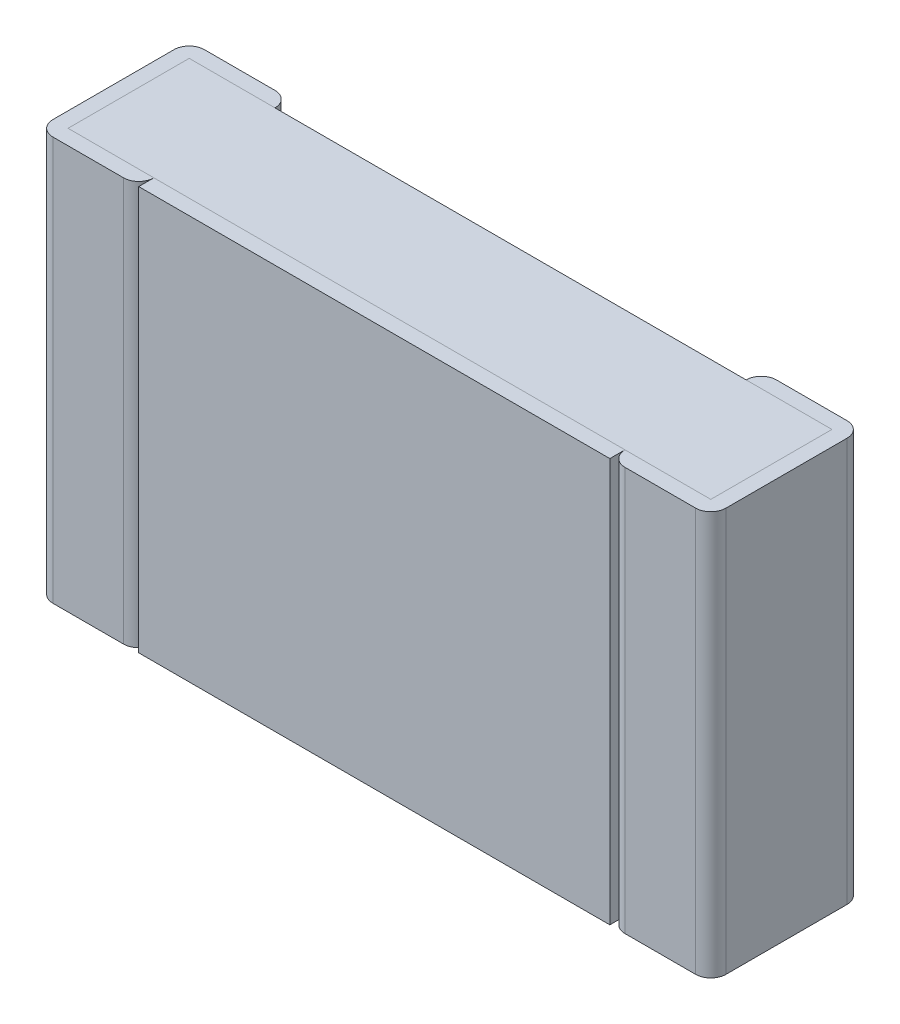
ISO-10303-21;
HEADER;
FILE_DESCRIPTION(('STEP AP214'),'2;1');
FILE_NAME('part.step','',(''),(''),'','','');
FILE_SCHEMA(('AUTOMOTIVE_DESIGN { 1 0 10303 214 1 1 1 1 }'));
ENDSEC;
DATA;
#1=APPLICATION_CONTEXT('core data for automotive mechanical design processes');
#2=APPLICATION_PROTOCOL_DEFINITION('international standard','automotive_design',2000,#1);
#3=PRODUCT_CONTEXT('',#1,'mechanical');
#4=PRODUCT('Part','Part','',(#3));
#5=PRODUCT_RELATED_PRODUCT_CATEGORY('part','',(#4));
#6=PRODUCT_DEFINITION_FORMATION('','',#4);
#7=PRODUCT_DEFINITION_CONTEXT('part definition',#1,'design');
#8=PRODUCT_DEFINITION('design','',#6,#7);
#9=PRODUCT_DEFINITION_SHAPE('','',#8);
#10=(LENGTH_UNIT() NAMED_UNIT(*) SI_UNIT(.MILLI.,.METRE.));
#11=(NAMED_UNIT(*) PLANE_ANGLE_UNIT() SI_UNIT($,.RADIAN.));
#12=(NAMED_UNIT(*) SI_UNIT($,.STERADIAN.) SOLID_ANGLE_UNIT());
#13=UNCERTAINTY_MEASURE_WITH_UNIT(LENGTH_MEASURE(1.E-05),#10,'distance_accuracy_value','');
#14=(GEOMETRIC_REPRESENTATION_CONTEXT(3) GLOBAL_UNCERTAINTY_ASSIGNED_CONTEXT((#13)) GLOBAL_UNIT_ASSIGNED_CONTEXT((#10,
#11,#12)) REPRESENTATION_CONTEXT('',''));
#15=CARTESIAN_POINT('',(0.,0.,0.));
#16=DIRECTION('',(0.,0.,1.));
#17=DIRECTION('',(1.,0.,0.));
#18=AXIS2_PLACEMENT_3D('',#15,#16,#17);
#19=CARTESIAN_POINT('',(-0.7,-0.6,0.45));
#20=DIRECTION('',(0.,0.,1.));
#21=DIRECTION('',(1.,0.,0.));
#22=AXIS2_PLACEMENT_3D('',#19,#20,#21);
#23=PLANE('',#22);
#24=DIRECTION('',(0.,1.,0.));
#25=VECTOR('',#24,1.);
#26=CARTESIAN_POINT('',(-0.7,-0.6,0.45));
#27=LINE('',#26,#25);
#28=CARTESIAN_POINT('',(-0.7,-0.6,0.45));
#29=VERTEX_POINT('',#28);
#30=CARTESIAN_POINT('',(-0.7,0.6,0.45));
#31=VERTEX_POINT('',#30);
#32=EDGE_CURVE('E263',#29,#31,#27,.T.);
#33=ORIENTED_EDGE('',*,*,#32,.F.);
#34=DIRECTION('',(1.,0.,0.));
#35=VECTOR('',#34,1.);
#36=CARTESIAN_POINT('',(-0.7,-0.6,0.45));
#37=LINE('',#36,#35);
#38=CARTESIAN_POINT('',(0.7,-0.6,0.45));
#39=VERTEX_POINT('',#38);
#40=EDGE_CURVE('E373',#29,#39,#37,.T.);
#41=ORIENTED_EDGE('',*,*,#40,.T.);
#42=DIRECTION('',(0.,1.,0.));
#43=VECTOR('',#42,1.);
#44=CARTESIAN_POINT('',(0.7,-0.6,0.45));
#45=LINE('',#44,#43);
#46=CARTESIAN_POINT('',(0.7,0.6,0.45));
#47=VERTEX_POINT('',#46);
#48=EDGE_CURVE('E11',#39,#47,#45,.T.);
#49=ORIENTED_EDGE('',*,*,#48,.T.);
#50=DIRECTION('',(1.,0.,0.));
#51=VECTOR('',#50,1.);
#52=CARTESIAN_POINT('',(-0.7,0.6,0.45));
#53=LINE('',#52,#51);
#54=EDGE_CURVE('E305',#31,#47,#53,.T.);
#55=ORIENTED_EDGE('',*,*,#54,.F.);
#56=EDGE_LOOP('',(#33,#41,#49,#55));
#57=FACE_BOUND('',#56,.T.);
#58=ADVANCED_FACE('F16',(#57),#23,.T.);
#59=CARTESIAN_POINT('',(0.7,-0.6,0.405));
#60=DIRECTION('',(1.,0.,0.));
#61=DIRECTION('',(0.,1.,0.));
#62=AXIS2_PLACEMENT_3D('',#59,#60,#61);
#63=PLANE('',#62);
#64=DIRECTION('',(0.,0.,1.));
#65=VECTOR('',#64,1.);
#66=CARTESIAN_POINT('',(0.7,-0.6,0.405));
#67=LINE('',#66,#65);
#68=CARTESIAN_POINT('',(0.7,-0.6,0.405));
#69=VERTEX_POINT('',#68);
#70=EDGE_CURVE('E328',#69,#39,#67,.T.);
#71=ORIENTED_EDGE('',*,*,#70,.F.);
#72=DIRECTION('',(0.,1.,0.));
#73=VECTOR('',#72,1.);
#74=CARTESIAN_POINT('',(0.7,-0.6,0.405));
#75=LINE('',#74,#73);
#76=CARTESIAN_POINT('',(0.7,0.6,0.405));
#77=VERTEX_POINT('',#76);
#78=EDGE_CURVE('E26',#69,#77,#75,.T.);
#79=ORIENTED_EDGE('',*,*,#78,.T.);
#80=DIRECTION('',(0.,0.,1.));
#81=VECTOR('',#80,1.);
#82=CARTESIAN_POINT('',(0.7,0.6,0.405));
#83=LINE('',#82,#81);
#84=EDGE_CURVE('E279',#77,#47,#83,.T.);
#85=ORIENTED_EDGE('',*,*,#84,.T.);
#86=ORIENTED_EDGE('',*,*,#48,.F.);
#87=EDGE_LOOP('',(#71,#79,#85,#86));
#88=FACE_BOUND('',#87,.T.);
#89=ADVANCED_FACE('F542',(#88),#63,.T.);
#90=CARTESIAN_POINT('',(0.745,-0.6,0.405));
#91=DIRECTION('',(0.,1.,0.));
#92=DIRECTION('',(-1.,0.,0.));
#93=AXIS2_PLACEMENT_3D('',#90,#91,#92);
#94=CYLINDRICAL_SURFACE('',#93,0.045);
#95=CARTESIAN_POINT('',(0.745,-0.6,0.405));
#96=DIRECTION('',(0.,1.,0.));
#97=DIRECTION('',(0.,0.,1.));
#98=AXIS2_PLACEMENT_3D('',#95,#96,#97);
#99=CIRCLE('',#98,0.045);
#100=CARTESIAN_POINT('',(0.745,-0.6,0.45));
#101=VERTEX_POINT('',#100);
#102=EDGE_CURVE('E208',#69,#101,#99,.T.);
#103=ORIENTED_EDGE('',*,*,#102,.T.);
#104=DIRECTION('',(0.,1.,0.));
#105=VECTOR('',#104,1.);
#106=CARTESIAN_POINT('',(0.745,-0.6,0.45));
#107=LINE('',#106,#105);
#108=CARTESIAN_POINT('',(0.745,0.6,0.45));
#109=VERTEX_POINT('',#108);
#110=EDGE_CURVE('E202',#101,#109,#107,.T.);
#111=ORIENTED_EDGE('',*,*,#110,.T.);
#112=CARTESIAN_POINT('',(0.745,0.6,0.405));
#113=DIRECTION('',(0.,1.,0.));
#114=DIRECTION('',(0.,0.,1.));
#115=AXIS2_PLACEMENT_3D('',#112,#113,#114);
#116=CIRCLE('',#115,0.045);
#117=EDGE_CURVE('E205',#77,#109,#116,.T.);
#118=ORIENTED_EDGE('',*,*,#117,.F.);
#119=ORIENTED_EDGE('',*,*,#78,.F.);
#120=EDGE_LOOP('',(#103,#111,#118,#119));
#121=FACE_BOUND('',#120,.T.);
#122=ADVANCED_FACE('F203',(#121),#94,.T.);
#123=CARTESIAN_POINT('',(0.7,-0.6,0.45));
#124=DIRECTION('',(0.,0.,1.));
#125=DIRECTION('',(1.,0.,0.));
#126=AXIS2_PLACEMENT_3D('',#123,#124,#125);
#127=PLANE('',#126);
#128=DIRECTION('',(1.,0.,0.));
#129=VECTOR('',#128,1.);
#130=CARTESIAN_POINT('',(0.7,0.6,0.45));
#131=LINE('',#130,#129);
#132=CARTESIAN_POINT('',(0.955,0.6,0.45));
#133=VERTEX_POINT('',#132);
#134=EDGE_CURVE('E213',#109,#133,#131,.T.);
#135=ORIENTED_EDGE('',*,*,#134,.F.);
#136=ORIENTED_EDGE('',*,*,#110,.F.);
#137=DIRECTION('',(1.,0.,0.));
#138=VECTOR('',#137,1.);
#139=CARTESIAN_POINT('',(0.7,-0.6,0.45));
#140=LINE('',#139,#138);
#141=CARTESIAN_POINT('',(0.955,-0.6,0.45));
#142=VERTEX_POINT('',#141);
#143=EDGE_CURVE('E248',#101,#142,#140,.T.);
#144=ORIENTED_EDGE('',*,*,#143,.T.);
#145=DIRECTION('',(0.,1.,0.));
#146=VECTOR('',#145,1.);
#147=CARTESIAN_POINT('',(0.955,-0.6,0.45));
#148=LINE('',#147,#146);
#149=EDGE_CURVE('E193',#142,#133,#148,.T.);
#150=ORIENTED_EDGE('',*,*,#149,.T.);
#151=EDGE_LOOP('',(#135,#136,#144,#150));
#152=FACE_BOUND('',#151,.T.);
#153=ADVANCED_FACE('F214',(#152),#127,.T.);
#154=CARTESIAN_POINT('',(0.955,-0.6,0.405));
#155=DIRECTION('',(0.,1.,0.));
#156=DIRECTION('',(1.,0.,0.));
#157=AXIS2_PLACEMENT_3D('',#154,#155,#156);
#158=CYLINDRICAL_SURFACE('',#157,0.045);
#159=DIRECTION('',(0.,1.,0.));
#160=VECTOR('',#159,1.);
#161=CARTESIAN_POINT('',(1.,-0.6,0.405));
#162=LINE('',#161,#160);
#163=CARTESIAN_POINT('',(1.,-0.6,0.405));
#164=VERTEX_POINT('',#163);
#165=CARTESIAN_POINT('',(1.,0.6,0.405));
#166=VERTEX_POINT('',#165);
#167=EDGE_CURVE('E258',#164,#166,#162,.T.);
#168=ORIENTED_EDGE('',*,*,#167,.T.);
#169=CARTESIAN_POINT('',(0.955,0.6,0.405));
#170=DIRECTION('',(0.,-1.,0.));
#171=DIRECTION('',(0.,0.,1.));
#172=AXIS2_PLACEMENT_3D('',#169,#170,#171);
#173=CIRCLE('',#172,0.045);
#174=EDGE_CURVE('E218',#166,#133,#173,.T.);
#175=ORIENTED_EDGE('',*,*,#174,.T.);
#176=ORIENTED_EDGE('',*,*,#149,.F.);
#177=CARTESIAN_POINT('',(0.955,-0.6,0.405));
#178=DIRECTION('',(0.,-1.,0.));
#179=DIRECTION('',(0.,0.,1.));
#180=AXIS2_PLACEMENT_3D('',#177,#178,#179);
#181=CIRCLE('',#180,0.045);
#182=EDGE_CURVE('E244',#164,#142,#181,.T.);
#183=ORIENTED_EDGE('',*,*,#182,.F.);
#184=EDGE_LOOP('',(#168,#175,#176,#183));
#185=FACE_BOUND('',#184,.T.);
#186=ADVANCED_FACE('F517',(#185),#158,.T.);
#187=CARTESIAN_POINT('',(1.,-0.6,0.));
#188=DIRECTION('',(1.,0.,0.));
#189=DIRECTION('',(0.,1.,0.));
#190=AXIS2_PLACEMENT_3D('',#187,#188,#189);
#191=PLANE('',#190);
#192=DIRECTION('',(0.,0.,1.));
#193=VECTOR('',#192,1.);
#194=CARTESIAN_POINT('',(1.,-0.6,0.));
#195=LINE('',#194,#193);
#196=CARTESIAN_POINT('',(1.,-0.6,0.045));
#197=VERTEX_POINT('',#196);
#198=EDGE_CURVE('E249',#197,#164,#195,.T.);
#199=ORIENTED_EDGE('',*,*,#198,.F.);
#200=DIRECTION('',(0.,1.,0.));
#201=VECTOR('',#200,1.);
#202=CARTESIAN_POINT('',(1.,-0.6,0.045));
#203=LINE('',#202,#201);
#204=CARTESIAN_POINT('',(1.,0.6,0.045));
#205=VERTEX_POINT('',#204);
#206=EDGE_CURVE('E272',#197,#205,#203,.T.);
#207=ORIENTED_EDGE('',*,*,#206,.T.);
#208=DIRECTION('',(0.,0.,1.));
#209=VECTOR('',#208,1.);
#210=CARTESIAN_POINT('',(1.,0.6,0.));
#211=LINE('',#210,#209);
#212=EDGE_CURVE('E332',#205,#166,#211,.T.);
#213=ORIENTED_EDGE('',*,*,#212,.T.);
#214=ORIENTED_EDGE('',*,*,#167,.F.);
#215=EDGE_LOOP('',(#199,#207,#213,#214));
#216=FACE_BOUND('',#215,.T.);
#217=ADVANCED_FACE('F514',(#216),#191,.T.);
#218=CARTESIAN_POINT('',(0.955,-0.6,0.045));
#219=DIRECTION('',(0.,1.,0.));
#220=DIRECTION('',(1.,0.,0.));
#221=AXIS2_PLACEMENT_3D('',#218,#219,#220);
#222=CYLINDRICAL_SURFACE('',#221,0.045);
#223=CARTESIAN_POINT('',(0.955,-0.6,0.045));
#224=DIRECTION('',(0.,1.,0.));
#225=DIRECTION('',(0.,0.,1.));
#226=AXIS2_PLACEMENT_3D('',#223,#224,#225);
#227=CIRCLE('',#226,0.045);
#228=CARTESIAN_POINT('',(0.955,-0.6,0.));
#229=VERTEX_POINT('',#228);
#230=EDGE_CURVE('E19',#197,#229,#227,.T.);
#231=ORIENTED_EDGE('',*,*,#230,.T.);
#232=DIRECTION('',(0.,1.,0.));
#233=VECTOR('',#232,1.);
#234=CARTESIAN_POINT('',(0.955,-0.6,0.));
#235=LINE('',#234,#233);
#236=CARTESIAN_POINT('',(0.955,0.6,0.));
#237=VERTEX_POINT('',#236);
#238=EDGE_CURVE('E275',#229,#237,#235,.T.);
#239=ORIENTED_EDGE('',*,*,#238,.T.);
#240=CARTESIAN_POINT('',(0.955,0.6,0.045));
#241=DIRECTION('',(0.,1.,0.));
#242=DIRECTION('',(0.,0.,1.));
#243=AXIS2_PLACEMENT_3D('',#240,#241,#242);
#244=CIRCLE('',#243,0.045);
#245=EDGE_CURVE('E329',#205,#237,#244,.T.);
#246=ORIENTED_EDGE('',*,*,#245,.F.);
#247=ORIENTED_EDGE('',*,*,#206,.F.);
#248=EDGE_LOOP('',(#231,#239,#246,#247));
#249=FACE_BOUND('',#248,.T.);
#250=ADVANCED_FACE('F409',(#249),#222,.T.);
#251=CARTESIAN_POINT('',(0.7,-0.6,0.));
#252=DIRECTION('',(0.,0.,1.));
#253=DIRECTION('',(1.,0.,0.));
#254=AXIS2_PLACEMENT_3D('',#251,#252,#253);
#255=PLANE('',#254);
#256=ORIENTED_EDGE('',*,*,#238,.F.);
#257=DIRECTION('',(1.,0.,0.));
#258=VECTOR('',#257,1.);
#259=CARTESIAN_POINT('',(0.7,-0.6,0.));
#260=LINE('',#259,#258);
#261=CARTESIAN_POINT('',(0.745,-0.6,0.));
#262=VERTEX_POINT('',#261);
#263=EDGE_CURVE('E324',#262,#229,#260,.T.);
#264=ORIENTED_EDGE('',*,*,#263,.F.);
#265=DIRECTION('',(0.,1.,0.));
#266=VECTOR('',#265,1.);
#267=CARTESIAN_POINT('',(0.745,-0.6,0.));
#268=LINE('',#267,#266);
#269=CARTESIAN_POINT('',(0.745,0.6,0.));
#270=VERTEX_POINT('',#269);
#271=EDGE_CURVE('E276',#262,#270,#268,.T.);
#272=ORIENTED_EDGE('',*,*,#271,.T.);
#273=DIRECTION('',(1.,0.,0.));
#274=VECTOR('',#273,1.);
#275=CARTESIAN_POINT('',(0.7,0.6,0.));
#276=LINE('',#275,#274);
#277=EDGE_CURVE('E232',#270,#237,#276,.T.);
#278=ORIENTED_EDGE('',*,*,#277,.T.);
#279=EDGE_LOOP('',(#256,#264,#272,#278));
#280=FACE_BOUND('',#279,.T.);
#281=ADVANCED_FACE('F511',(#280),#255,.F.);
#282=CARTESIAN_POINT('',(0.745,-0.6,0.045));
#283=DIRECTION('',(0.,1.,0.));
#284=DIRECTION('',(-1.,0.,0.));
#285=AXIS2_PLACEMENT_3D('',#282,#283,#284);
#286=CYLINDRICAL_SURFACE('',#285,0.045);
#287=DIRECTION('',(0.,1.,0.));
#288=VECTOR('',#287,1.);
#289=CARTESIAN_POINT('',(0.7,-0.6,0.045));
#290=LINE('',#289,#288);
#291=CARTESIAN_POINT('',(0.7,-0.6,0.045));
#292=VERTEX_POINT('',#291);
#293=CARTESIAN_POINT('',(0.7,0.6,0.045));
#294=VERTEX_POINT('',#293);
#295=EDGE_CURVE('E268',#292,#294,#290,.T.);
#296=ORIENTED_EDGE('',*,*,#295,.T.);
#297=CARTESIAN_POINT('',(0.745,0.6,0.045));
#298=DIRECTION('',(0.,-1.,0.));
#299=DIRECTION('',(0.,0.,1.));
#300=AXIS2_PLACEMENT_3D('',#297,#298,#299);
#301=CIRCLE('',#300,0.045);
#302=EDGE_CURVE('E226',#294,#270,#301,.T.);
#303=ORIENTED_EDGE('',*,*,#302,.T.);
#304=ORIENTED_EDGE('',*,*,#271,.F.);
#305=CARTESIAN_POINT('',(0.745,-0.6,0.045));
#306=DIRECTION('',(0.,-1.,0.));
#307=DIRECTION('',(0.,0.,1.));
#308=AXIS2_PLACEMENT_3D('',#305,#306,#307);
#309=CIRCLE('',#308,0.045);
#310=EDGE_CURVE('E142',#292,#262,#309,.T.);
#311=ORIENTED_EDGE('',*,*,#310,.F.);
#312=EDGE_LOOP('',(#296,#303,#304,#311));
#313=FACE_BOUND('',#312,.T.);
#314=ADVANCED_FACE('F527',(#313),#286,.T.);
#315=CARTESIAN_POINT('',(-0.7,0.6,0.405));
#316=DIRECTION('',(0.,1.,0.));
#317=DIRECTION('',(1.,0.,0.));
#318=AXIS2_PLACEMENT_3D('',#315,#316,#317);
#319=PLANE('',#318);
#320=DIRECTION('',(1.,0.,0.));
#321=VECTOR('',#320,1.);
#322=CARTESIAN_POINT('',(-0.7,0.6,0.405));
#323=LINE('',#322,#321);
#324=CARTESIAN_POINT('',(-0.7,0.6,0.405));
#325=VERTEX_POINT('',#324);
#326=EDGE_CURVE('E306',#325,#77,#323,.T.);
#327=ORIENTED_EDGE('',*,*,#326,.F.);
#328=DIRECTION('',(0.,0.,1.));
#329=VECTOR('',#328,1.);
#330=CARTESIAN_POINT('',(-0.7,0.6,0.405));
#331=LINE('',#330,#329);
#332=EDGE_CURVE('E259',#325,#31,#331,.T.);
#333=ORIENTED_EDGE('',*,*,#332,.T.);
#334=ORIENTED_EDGE('',*,*,#54,.T.);
#335=ORIENTED_EDGE('',*,*,#84,.F.);
#336=EDGE_LOOP('',(#327,#333,#334,#335));
#337=FACE_BOUND('',#336,.T.);
#338=ADVANCED_FACE('F529',(#337),#319,.T.);
#339=CARTESIAN_POINT('',(0.7,0.6,0.));
#340=DIRECTION('',(0.,1.,0.));
#341=DIRECTION('',(1.,0.,0.));
#342=AXIS2_PLACEMENT_3D('',#339,#340,#341);
#343=PLANE('',#342);
#344=ORIENTED_EDGE('',*,*,#277,.F.);
#345=ORIENTED_EDGE('',*,*,#302,.F.);
#346=DIRECTION('',(1.,0.,0.));
#347=VECTOR('',#346,1.);
#348=CARTESIAN_POINT('',(-0.955,0.6,0.045));
#349=LINE('',#348,#347);
#350=CARTESIAN_POINT('',(0.955,0.6,0.045));
#351=VERTEX_POINT('',#350);
#352=EDGE_CURVE('E388',#294,#351,#349,.T.);
#353=ORIENTED_EDGE('',*,*,#352,.T.);
#354=DIRECTION('',(0.,0.,1.));
#355=VECTOR('',#354,1.);
#356=CARTESIAN_POINT('',(0.955,0.6,0.045));
#357=LINE('',#356,#355);
#358=CARTESIAN_POINT('',(0.955,0.6,0.405));
#359=VERTEX_POINT('',#358);
#360=EDGE_CURVE('E359',#351,#359,#357,.T.);
#361=ORIENTED_EDGE('',*,*,#360,.T.);
#362=DIRECTION('',(1.,0.,0.));
#363=VECTOR('',#362,1.);
#364=CARTESIAN_POINT('',(-0.955,0.6,0.405));
#365=LINE('',#364,#363);
#366=EDGE_CURVE('E223',#77,#359,#365,.T.);
#367=ORIENTED_EDGE('',*,*,#366,.F.);
#368=ORIENTED_EDGE('',*,*,#117,.T.);
#369=ORIENTED_EDGE('',*,*,#134,.T.);
#370=ORIENTED_EDGE('',*,*,#174,.F.);
#371=ORIENTED_EDGE('',*,*,#212,.F.);
#372=ORIENTED_EDGE('',*,*,#245,.T.);
#373=EDGE_LOOP('',(#344,#345,#353,#361,#367,#368,#369,#370,#371,#372));
#374=FACE_BOUND('',#373,.T.);
#375=ADVANCED_FACE('F221',(#374),#343,.T.);
#376=CARTESIAN_POINT('',(-0.7,-0.6,0.405));
#377=DIRECTION('',(1.,0.,0.));
#378=DIRECTION('',(0.,1.,0.));
#379=AXIS2_PLACEMENT_3D('',#376,#377,#378);
#380=PLANE('',#379);
#381=ORIENTED_EDGE('',*,*,#32,.T.);
#382=ORIENTED_EDGE('',*,*,#332,.F.);
#383=DIRECTION('',(0.,1.,0.));
#384=VECTOR('',#383,1.);
#385=CARTESIAN_POINT('',(-0.7,-0.6,0.405));
#386=LINE('',#385,#384);
#387=CARTESIAN_POINT('',(-0.7,-0.6,0.405));
#388=VERTEX_POINT('',#387);
#389=EDGE_CURVE('E309',#388,#325,#386,.T.);
#390=ORIENTED_EDGE('',*,*,#389,.F.);
#391=DIRECTION('',(0.,0.,1.));
#392=VECTOR('',#391,1.);
#393=CARTESIAN_POINT('',(-0.7,-0.6,0.405));
#394=LINE('',#393,#392);
#395=EDGE_CURVE('E291',#388,#29,#394,.T.);
#396=ORIENTED_EDGE('',*,*,#395,.T.);
#397=EDGE_LOOP('',(#381,#382,#390,#396));
#398=FACE_BOUND('',#397,.T.);
#399=ADVANCED_FACE('F549',(#398),#380,.F.);
#400=CARTESIAN_POINT('',(-0.7,-0.6,0.405));
#401=DIRECTION('',(0.,1.,0.));
#402=DIRECTION('',(1.,0.,0.));
#403=AXIS2_PLACEMENT_3D('',#400,#401,#402);
#404=PLANE('',#403);
#405=ORIENTED_EDGE('',*,*,#70,.T.);
#406=ORIENTED_EDGE('',*,*,#40,.F.);
#407=ORIENTED_EDGE('',*,*,#395,.F.);
#408=DIRECTION('',(1.,0.,0.));
#409=VECTOR('',#408,1.);
#410=CARTESIAN_POINT('',(-0.7,-0.6,0.405));
#411=LINE('',#410,#409);
#412=EDGE_CURVE('E297',#388,#69,#411,.T.);
#413=ORIENTED_EDGE('',*,*,#412,.T.);
#414=EDGE_LOOP('',(#405,#406,#407,#413));
#415=FACE_BOUND('',#414,.T.);
#416=ADVANCED_FACE('F520',(#415),#404,.F.);
#417=CARTESIAN_POINT('',(0.7,-0.6,0.));
#418=DIRECTION('',(0.,1.,0.));
#419=DIRECTION('',(1.,0.,0.));
#420=AXIS2_PLACEMENT_3D('',#417,#418,#419);
#421=PLANE('',#420);
#422=ORIENTED_EDGE('',*,*,#230,.F.);
#423=ORIENTED_EDGE('',*,*,#198,.T.);
#424=ORIENTED_EDGE('',*,*,#182,.T.);
#425=ORIENTED_EDGE('',*,*,#143,.F.);
#426=ORIENTED_EDGE('',*,*,#102,.F.);
#427=DIRECTION('',(1.,0.,0.));
#428=VECTOR('',#427,1.);
#429=CARTESIAN_POINT('',(-0.955,-0.6,0.405));
#430=LINE('',#429,#428);
#431=CARTESIAN_POINT('',(0.955,-0.6,0.405));
#432=VERTEX_POINT('',#431);
#433=EDGE_CURVE('E302',#69,#432,#430,.T.);
#434=ORIENTED_EDGE('',*,*,#433,.T.);
#435=DIRECTION('',(0.,0.,1.));
#436=VECTOR('',#435,1.);
#437=CARTESIAN_POINT('',(0.955,-0.6,0.045));
#438=LINE('',#437,#436);
#439=CARTESIAN_POINT('',(0.955,-0.6,0.045));
#440=VERTEX_POINT('',#439);
#441=EDGE_CURVE('E153',#440,#432,#438,.T.);
#442=ORIENTED_EDGE('',*,*,#441,.F.);
#443=DIRECTION('',(1.,0.,0.));
#444=VECTOR('',#443,1.);
#445=CARTESIAN_POINT('',(-0.955,-0.6,0.045));
#446=LINE('',#445,#444);
#447=EDGE_CURVE('E379',#292,#440,#446,.T.);
#448=ORIENTED_EDGE('',*,*,#447,.F.);
#449=ORIENTED_EDGE('',*,*,#310,.T.);
#450=ORIENTED_EDGE('',*,*,#263,.T.);
#451=EDGE_LOOP('',(#422,#423,#424,#425,#426,#434,#442,#448,#449,#450));
#452=FACE_BOUND('',#451,.T.);
#453=ADVANCED_FACE('F411',(#452),#421,.F.);
#454=CARTESIAN_POINT('',(-0.955,-0.6,0.045));
#455=DIRECTION('',(0.,0.,1.));
#456=DIRECTION('',(1.,0.,0.));
#457=AXIS2_PLACEMENT_3D('',#454,#455,#456);
#458=PLANE('',#457);
#459=DIRECTION('',(1.,0.,0.));
#460=VECTOR('',#459,1.);
#461=CARTESIAN_POINT('',(-0.955,0.6,0.045));
#462=LINE('',#461,#460);
#463=CARTESIAN_POINT('',(-0.7,0.6,0.045));
#464=VERTEX_POINT('',#463);
#465=EDGE_CURVE('E271',#464,#294,#462,.T.);
#466=ORIENTED_EDGE('',*,*,#465,.T.);
#467=ORIENTED_EDGE('',*,*,#295,.F.);
#468=DIRECTION('',(1.,0.,0.));
#469=VECTOR('',#468,1.);
#470=CARTESIAN_POINT('',(-0.955,-0.6,0.045));
#471=LINE('',#470,#469);
#472=CARTESIAN_POINT('',(-0.7,-0.6,0.045));
#473=VERTEX_POINT('',#472);
#474=EDGE_CURVE('E382',#473,#292,#471,.T.);
#475=ORIENTED_EDGE('',*,*,#474,.F.);
#476=DIRECTION('',(0.,1.,0.));
#477=VECTOR('',#476,1.);
#478=CARTESIAN_POINT('',(-0.7,-0.6,0.045));
#479=LINE('',#478,#477);
#480=EDGE_CURVE('E355',#473,#464,#479,.T.);
#481=ORIENTED_EDGE('',*,*,#480,.T.);
#482=EDGE_LOOP('',(#466,#467,#475,#481));
#483=FACE_BOUND('',#482,.T.);
#484=ADVANCED_FACE('F525',(#483),#458,.F.);
#485=CARTESIAN_POINT('',(-0.955,0.6,0.045));
#486=DIRECTION('',(0.,1.,0.));
#487=DIRECTION('',(1.,0.,0.));
#488=AXIS2_PLACEMENT_3D('',#485,#486,#487);
#489=PLANE('',#488);
#490=DIRECTION('',(1.,0.,0.));
#491=VECTOR('',#490,1.);
#492=CARTESIAN_POINT('',(-0.955,0.6,0.045));
#493=LINE('',#492,#491);
#494=CARTESIAN_POINT('',(-0.955,0.6,0.045));
#495=VERTEX_POINT('',#494);
#496=EDGE_CURVE('E235',#495,#464,#493,.T.);
#497=ORIENTED_EDGE('',*,*,#496,.F.);
#498=DIRECTION('',(0.,0.,1.));
#499=VECTOR('',#498,1.);
#500=CARTESIAN_POINT('',(-0.955,0.6,0.045));
#501=LINE('',#500,#499);
#502=CARTESIAN_POINT('',(-0.955,0.6,0.405));
#503=VERTEX_POINT('',#502);
#504=EDGE_CURVE('E376',#495,#503,#501,.T.);
#505=ORIENTED_EDGE('',*,*,#504,.T.);
#506=DIRECTION('',(1.,0.,0.));
#507=VECTOR('',#506,1.);
#508=CARTESIAN_POINT('',(-0.955,0.6,0.405));
#509=LINE('',#508,#507);
#510=EDGE_CURVE('E319',#503,#325,#509,.T.);
#511=ORIENTED_EDGE('',*,*,#510,.T.);
#512=ORIENTED_EDGE('',*,*,#326,.T.);
#513=ORIENTED_EDGE('',*,*,#366,.T.);
#514=ORIENTED_EDGE('',*,*,#360,.F.);
#515=ORIENTED_EDGE('',*,*,#352,.F.);
#516=ORIENTED_EDGE('',*,*,#465,.F.);
#517=EDGE_LOOP('',(#497,#505,#511,#512,#513,#514,#515,#516));
#518=FACE_BOUND('',#517,.T.);
#519=ADVANCED_FACE('F556',(#518),#489,.T.);
#520=CARTESIAN_POINT('',(-0.745,-0.6,0.405));
#521=DIRECTION('',(0.,1.,0.));
#522=DIRECTION('',(1.,0.,0.));
#523=AXIS2_PLACEMENT_3D('',#520,#521,#522);
#524=CYLINDRICAL_SURFACE('',#523,0.045);
#525=ORIENTED_EDGE('',*,*,#389,.T.);
#526=CARTESIAN_POINT('',(-0.745,0.6,0.405));
#527=DIRECTION('',(0.,-1.,0.));
#528=DIRECTION('',(0.,0.,1.));
#529=AXIS2_PLACEMENT_3D('',#526,#527,#528);
#530=CIRCLE('',#529,0.045);
#531=CARTESIAN_POINT('',(-0.745,0.6,0.45));
#532=VERTEX_POINT('',#531);
#533=EDGE_CURVE('E315',#325,#532,#530,.T.);
#534=ORIENTED_EDGE('',*,*,#533,.T.);
#535=DIRECTION('',(0.,1.,0.));
#536=VECTOR('',#535,1.);
#537=CARTESIAN_POINT('',(-0.745,-0.6,0.45));
#538=LINE('',#537,#536);
#539=CARTESIAN_POINT('',(-0.745,-0.6,0.45));
#540=VERTEX_POINT('',#539);
#541=EDGE_CURVE('E301',#540,#532,#538,.T.);
#542=ORIENTED_EDGE('',*,*,#541,.F.);
#543=CARTESIAN_POINT('',(-0.745,-0.6,0.405));
#544=DIRECTION('',(0.,-1.,0.));
#545=DIRECTION('',(0.,0.,1.));
#546=AXIS2_PLACEMENT_3D('',#543,#544,#545);
#547=CIRCLE('',#546,0.045);
#548=EDGE_CURVE('E383',#388,#540,#547,.T.);
#549=ORIENTED_EDGE('',*,*,#548,.F.);
#550=EDGE_LOOP('',(#525,#534,#542,#549));
#551=FACE_BOUND('',#550,.T.);
#552=ADVANCED_FACE('F552',(#551),#524,.T.);
#553=CARTESIAN_POINT('',(-1.,-0.6,0.45));
#554=DIRECTION('',(0.,0.,1.));
#555=DIRECTION('',(1.,0.,0.));
#556=AXIS2_PLACEMENT_3D('',#553,#554,#555);
#557=PLANE('',#556);
#558=DIRECTION('',(1.,0.,0.));
#559=VECTOR('',#558,1.);
#560=CARTESIAN_POINT('',(-1.,0.6,0.45));
#561=LINE('',#560,#559);
#562=CARTESIAN_POINT('',(-0.955,0.6,0.45));
#563=VERTEX_POINT('',#562);
#564=EDGE_CURVE('E284',#563,#532,#561,.T.);
#565=ORIENTED_EDGE('',*,*,#564,.F.);
#566=DIRECTION('',(0.,1.,0.));
#567=VECTOR('',#566,1.);
#568=CARTESIAN_POINT('',(-0.955,-0.6,0.45));
#569=LINE('',#568,#567);
#570=CARTESIAN_POINT('',(-0.955,-0.6,0.45));
#571=VERTEX_POINT('',#570);
#572=EDGE_CURVE('E253',#571,#563,#569,.T.);
#573=ORIENTED_EDGE('',*,*,#572,.F.);
#574=DIRECTION('',(1.,0.,0.));
#575=VECTOR('',#574,1.);
#576=CARTESIAN_POINT('',(-1.,-0.6,0.45));
#577=LINE('',#576,#575);
#578=EDGE_CURVE('E387',#571,#540,#577,.T.);
#579=ORIENTED_EDGE('',*,*,#578,.T.);
#580=ORIENTED_EDGE('',*,*,#541,.T.);
#581=EDGE_LOOP('',(#565,#573,#579,#580));
#582=FACE_BOUND('',#581,.T.);
#583=ADVANCED_FACE('F562',(#582),#557,.T.);
#584=CARTESIAN_POINT('',(-0.955,-0.6,0.045));
#585=DIRECTION('',(0.,1.,0.));
#586=DIRECTION('',(1.,0.,0.));
#587=AXIS2_PLACEMENT_3D('',#584,#585,#586);
#588=PLANE('',#587);
#589=ORIENTED_EDGE('',*,*,#474,.T.);
#590=ORIENTED_EDGE('',*,*,#447,.T.);
#591=ORIENTED_EDGE('',*,*,#441,.T.);
#592=ORIENTED_EDGE('',*,*,#433,.F.);
#593=ORIENTED_EDGE('',*,*,#412,.F.);
#594=DIRECTION('',(1.,0.,0.));
#595=VECTOR('',#594,1.);
#596=CARTESIAN_POINT('',(-0.955,-0.6,0.405));
#597=LINE('',#596,#595);
#598=CARTESIAN_POINT('',(-0.955,-0.6,0.405));
#599=VERTEX_POINT('',#598);
#600=EDGE_CURVE('E296',#599,#388,#597,.T.);
#601=ORIENTED_EDGE('',*,*,#600,.F.);
#602=DIRECTION('',(0.,0.,1.));
#603=VECTOR('',#602,1.);
#604=CARTESIAN_POINT('',(-0.955,-0.6,0.045));
#605=LINE('',#604,#603);
#606=CARTESIAN_POINT('',(-0.955,-0.6,0.045));
#607=VERTEX_POINT('',#606);
#608=EDGE_CURVE('E292',#607,#599,#605,.T.);
#609=ORIENTED_EDGE('',*,*,#608,.F.);
#610=DIRECTION('',(1.,0.,0.));
#611=VECTOR('',#610,1.);
#612=CARTESIAN_POINT('',(-0.955,-0.6,0.045));
#613=LINE('',#612,#611);
#614=EDGE_CURVE('E242',#607,#473,#613,.T.);
#615=ORIENTED_EDGE('',*,*,#614,.T.);
#616=EDGE_LOOP('',(#589,#590,#591,#592,#593,#601,#609,#615));
#617=FACE_BOUND('',#616,.T.);
#618=ADVANCED_FACE('F452',(#617),#588,.F.);
#619=CARTESIAN_POINT('',(-0.745,-0.6,0.045));
#620=DIRECTION('',(0.,1.,0.));
#621=DIRECTION('',(1.,0.,0.));
#622=AXIS2_PLACEMENT_3D('',#619,#620,#621);
#623=CYLINDRICAL_SURFACE('',#622,0.045);
#624=CARTESIAN_POINT('',(-0.745,-0.6,0.045));
#625=DIRECTION('',(0.,1.,0.));
#626=DIRECTION('',(0.,0.,1.));
#627=AXIS2_PLACEMENT_3D('',#624,#625,#626);
#628=CIRCLE('',#627,0.045);
#629=CARTESIAN_POINT('',(-0.745,-0.6,0.));
#630=VERTEX_POINT('',#629);
#631=EDGE_CURVE('E238',#473,#630,#628,.T.);
#632=ORIENTED_EDGE('',*,*,#631,.T.);
#633=DIRECTION('',(0.,1.,0.));
#634=VECTOR('',#633,1.);
#635=CARTESIAN_POINT('',(-0.745,-0.6,0.));
#636=LINE('',#635,#634);
#637=CARTESIAN_POINT('',(-0.745,0.6,0.));
#638=VERTEX_POINT('',#637);
#639=EDGE_CURVE('E352',#630,#638,#636,.T.);
#640=ORIENTED_EDGE('',*,*,#639,.T.);
#641=CARTESIAN_POINT('',(-0.745,0.6,0.045));
#642=DIRECTION('',(0.,1.,0.));
#643=DIRECTION('',(0.,0.,1.));
#644=AXIS2_PLACEMENT_3D('',#641,#642,#643);
#645=CIRCLE('',#644,0.045);
#646=EDGE_CURVE('E356',#464,#638,#645,.T.);
#647=ORIENTED_EDGE('',*,*,#646,.F.);
#648=ORIENTED_EDGE('',*,*,#480,.F.);
#649=EDGE_LOOP('',(#632,#640,#647,#648));
#650=FACE_BOUND('',#649,.T.);
#651=ADVANCED_FACE('F462',(#650),#623,.T.);
#652=CARTESIAN_POINT('',(-1.,-0.6,0.));
#653=DIRECTION('',(0.,0.,1.));
#654=DIRECTION('',(1.,0.,0.));
#655=AXIS2_PLACEMENT_3D('',#652,#653,#654);
#656=PLANE('',#655);
#657=ORIENTED_EDGE('',*,*,#639,.F.);
#658=DIRECTION('',(1.,0.,0.));
#659=VECTOR('',#658,1.);
#660=CARTESIAN_POINT('',(-1.,-0.6,0.));
#661=LINE('',#660,#659);
#662=CARTESIAN_POINT('',(-0.955,-0.6,0.));
#663=VERTEX_POINT('',#662);
#664=EDGE_CURVE('E323',#663,#630,#661,.T.);
#665=ORIENTED_EDGE('',*,*,#664,.F.);
#666=DIRECTION('',(0.,1.,0.));
#667=VECTOR('',#666,1.);
#668=CARTESIAN_POINT('',(-0.955,-0.6,0.));
#669=LINE('',#668,#667);
#670=CARTESIAN_POINT('',(-0.955,0.6,0.));
#671=VERTEX_POINT('',#670);
#672=EDGE_CURVE('E250',#663,#671,#669,.T.);
#673=ORIENTED_EDGE('',*,*,#672,.T.);
#674=DIRECTION('',(1.,0.,0.));
#675=VECTOR('',#674,1.);
#676=CARTESIAN_POINT('',(-1.,0.6,0.));
#677=LINE('',#676,#675);
#678=EDGE_CURVE('E280',#671,#638,#677,.T.);
#679=ORIENTED_EDGE('',*,*,#678,.T.);
#680=EDGE_LOOP('',(#657,#665,#673,#679));
#681=FACE_BOUND('',#680,.T.);
#682=ADVANCED_FACE('F576',(#681),#656,.F.);
#683=CARTESIAN_POINT('',(-1.,0.6,0.));
#684=DIRECTION('',(0.,1.,0.));
#685=DIRECTION('',(1.,0.,0.));
#686=AXIS2_PLACEMENT_3D('',#683,#684,#685);
#687=PLANE('',#686);
#688=ORIENTED_EDGE('',*,*,#678,.F.);
#689=CARTESIAN_POINT('',(-0.955,0.6,0.045));
#690=DIRECTION('',(0.,-1.,0.));
#691=DIRECTION('',(0.,0.,1.));
#692=AXIS2_PLACEMENT_3D('',#689,#690,#691);
#693=CIRCLE('',#692,0.045);
#694=CARTESIAN_POINT('',(-1.,0.6,0.045));
#695=VERTEX_POINT('',#694);
#696=EDGE_CURVE('E254',#695,#671,#693,.T.);
#697=ORIENTED_EDGE('',*,*,#696,.F.);
#698=DIRECTION('',(0.,0.,1.));
#699=VECTOR('',#698,1.);
#700=CARTESIAN_POINT('',(-1.,0.6,0.));
#701=LINE('',#700,#699);
#702=CARTESIAN_POINT('',(-1.,0.6,0.405));
#703=VERTEX_POINT('',#702);
#704=EDGE_CURVE('E314',#695,#703,#701,.T.);
#705=ORIENTED_EDGE('',*,*,#704,.T.);
#706=CARTESIAN_POINT('',(-0.955,0.6,0.405));
#707=DIRECTION('',(0.,1.,0.));
#708=DIRECTION('',(0.,0.,1.));
#709=AXIS2_PLACEMENT_3D('',#706,#707,#708);
#710=CIRCLE('',#709,0.045);
#711=EDGE_CURVE('E285',#703,#563,#710,.T.);
#712=ORIENTED_EDGE('',*,*,#711,.T.);
#713=ORIENTED_EDGE('',*,*,#564,.T.);
#714=ORIENTED_EDGE('',*,*,#533,.F.);
#715=ORIENTED_EDGE('',*,*,#510,.F.);
#716=ORIENTED_EDGE('',*,*,#504,.F.);
#717=ORIENTED_EDGE('',*,*,#496,.T.);
#718=ORIENTED_EDGE('',*,*,#646,.T.);
#719=EDGE_LOOP('',(#688,#697,#705,#712,#713,#714,#715,#716,#717,#718));
#720=FACE_BOUND('',#719,.T.);
#721=ADVANCED_FACE('F559',(#720),#687,.T.);
#722=CARTESIAN_POINT('',(-0.955,-0.6,0.405));
#723=DIRECTION('',(0.,1.,0.));
#724=DIRECTION('',(-1.,0.,0.));
#725=AXIS2_PLACEMENT_3D('',#722,#723,#724);
#726=CYLINDRICAL_SURFACE('',#725,0.045);
#727=CARTESIAN_POINT('',(-0.955,-0.6,0.405));
#728=DIRECTION('',(0.,1.,0.));
#729=DIRECTION('',(0.,0.,1.));
#730=AXIS2_PLACEMENT_3D('',#727,#728,#729);
#731=CIRCLE('',#730,0.045);
#732=CARTESIAN_POINT('',(-1.,-0.6,0.405));
#733=VERTEX_POINT('',#732);
#734=EDGE_CURVE('E446',#733,#571,#731,.T.);
#735=ORIENTED_EDGE('',*,*,#734,.T.);
#736=ORIENTED_EDGE('',*,*,#572,.T.);
#737=ORIENTED_EDGE('',*,*,#711,.F.);
#738=DIRECTION('',(0.,1.,0.));
#739=VECTOR('',#738,1.);
#740=CARTESIAN_POINT('',(-1.,-0.6,0.405));
#741=LINE('',#740,#739);
#742=EDGE_CURVE('E310',#733,#703,#741,.T.);
#743=ORIENTED_EDGE('',*,*,#742,.F.);
#744=EDGE_LOOP('',(#735,#736,#737,#743));
#745=FACE_BOUND('',#744,.T.);
#746=ADVANCED_FACE('F568',(#745),#726,.T.);
#747=CARTESIAN_POINT('',(-0.955,-0.6,0.045));
#748=DIRECTION('',(0.,1.,0.));
#749=DIRECTION('',(-1.,0.,0.));
#750=AXIS2_PLACEMENT_3D('',#747,#748,#749);
#751=CYLINDRICAL_SURFACE('',#750,0.045);
#752=DIRECTION('',(0.,1.,0.));
#753=VECTOR('',#752,1.);
#754=CARTESIAN_POINT('',(-1.,-0.6,0.045));
#755=LINE('',#754,#753);
#756=CARTESIAN_POINT('',(-1.,-0.6,0.045));
#757=VERTEX_POINT('',#756);
#758=EDGE_CURVE('E267',#757,#695,#755,.T.);
#759=ORIENTED_EDGE('',*,*,#758,.T.);
#760=ORIENTED_EDGE('',*,*,#696,.T.);
#761=ORIENTED_EDGE('',*,*,#672,.F.);
#762=CARTESIAN_POINT('',(-0.955,-0.6,0.045));
#763=DIRECTION('',(0.,-1.,0.));
#764=DIRECTION('',(0.,0.,1.));
#765=AXIS2_PLACEMENT_3D('',#762,#763,#764);
#766=CIRCLE('',#765,0.045);
#767=EDGE_CURVE('E479',#757,#663,#766,.T.);
#768=ORIENTED_EDGE('',*,*,#767,.F.);
#769=EDGE_LOOP('',(#759,#760,#761,#768));
#770=FACE_BOUND('',#769,.T.);
#771=ADVANCED_FACE('F574',(#770),#751,.T.);
#772=CARTESIAN_POINT('',(-1.,-0.6,0.));
#773=DIRECTION('',(0.,1.,0.));
#774=DIRECTION('',(1.,0.,0.));
#775=AXIS2_PLACEMENT_3D('',#772,#773,#774);
#776=PLANE('',#775);
#777=ORIENTED_EDGE('',*,*,#631,.F.);
#778=ORIENTED_EDGE('',*,*,#614,.F.);
#779=ORIENTED_EDGE('',*,*,#608,.T.);
#780=ORIENTED_EDGE('',*,*,#600,.T.);
#781=ORIENTED_EDGE('',*,*,#548,.T.);
#782=ORIENTED_EDGE('',*,*,#578,.F.);
#783=ORIENTED_EDGE('',*,*,#734,.F.);
#784=DIRECTION('',(0.,0.,1.));
#785=VECTOR('',#784,1.);
#786=CARTESIAN_POINT('',(-1.,-0.6,0.));
#787=LINE('',#786,#785);
#788=EDGE_CURVE('E243',#757,#733,#787,.T.);
#789=ORIENTED_EDGE('',*,*,#788,.F.);
#790=ORIENTED_EDGE('',*,*,#767,.T.);
#791=ORIENTED_EDGE('',*,*,#664,.T.);
#792=EDGE_LOOP('',(#777,#778,#779,#780,#781,#782,#783,#789,#790,#791));
#793=FACE_BOUND('',#792,.T.);
#794=ADVANCED_FACE('F456',(#793),#776,.F.);
#795=CARTESIAN_POINT('',(-1.,-0.6,0.));
#796=DIRECTION('',(1.,0.,0.));
#797=DIRECTION('',(0.,1.,0.));
#798=AXIS2_PLACEMENT_3D('',#795,#796,#797);
#799=PLANE('',#798);
#800=ORIENTED_EDGE('',*,*,#742,.T.);
#801=ORIENTED_EDGE('',*,*,#704,.F.);
#802=ORIENTED_EDGE('',*,*,#758,.F.);
#803=ORIENTED_EDGE('',*,*,#788,.T.);
#804=EDGE_LOOP('',(#800,#801,#802,#803));
#805=FACE_BOUND('',#804,.T.);
#806=ADVANCED_FACE('F571',(#805),#799,.F.);
#807=CLOSED_SHELL('',(#58,#89,#122,#153,#186,#217,#250,#281,#314,#338,#375,#399,#416,#453,#484,
#519,#552,#583,#618,#651,#682,#721,#746,#771,#794,#806));
#808=MANIFOLD_SOLID_BREP('B1',#807);
#809=ADVANCED_BREP_SHAPE_REPRESENTATION('',(#18,#808),#14);
#810=SHAPE_DEFINITION_REPRESENTATION(#9,#809);
ENDSEC;
END-ISO-10303-21;
